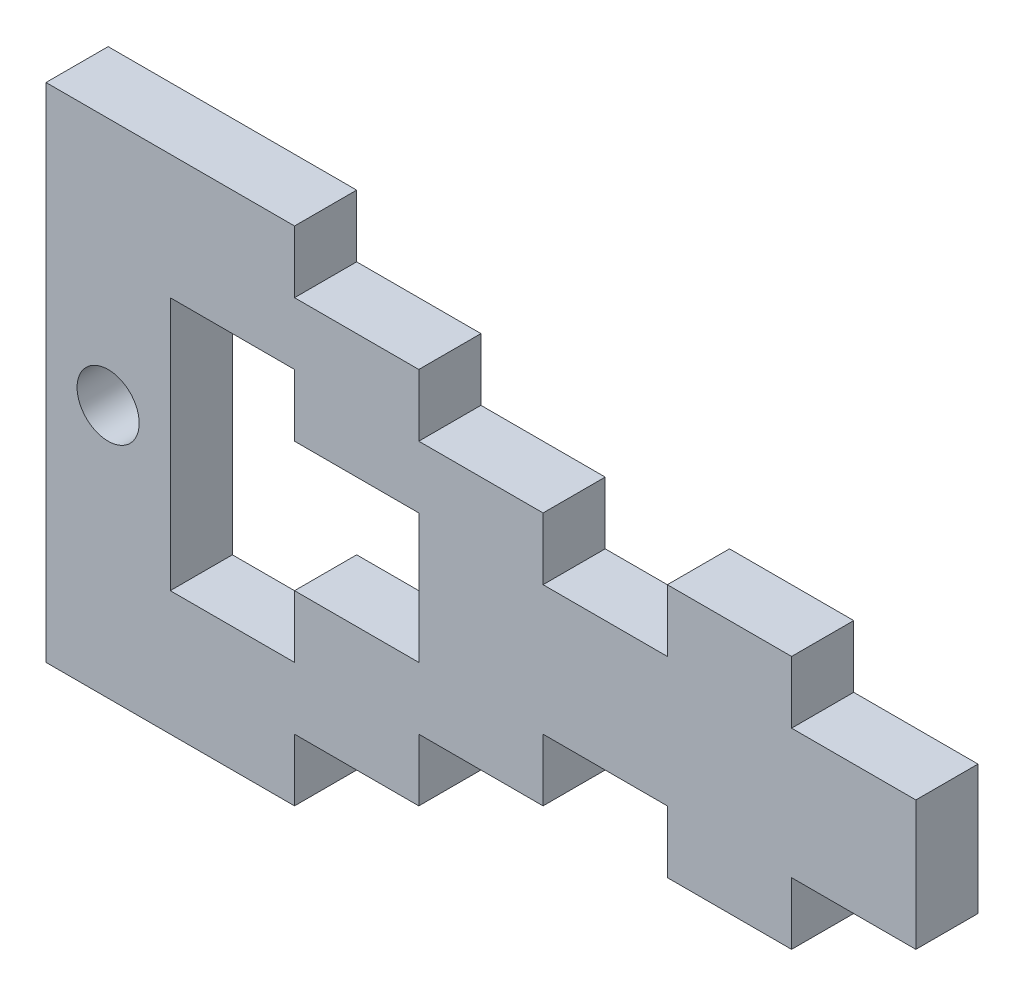
ISO-10303-21;
HEADER;
FILE_DESCRIPTION(('STEP AP214'),'2;1');
FILE_NAME('part.step','',(''),(''),'','','');
FILE_SCHEMA(('AUTOMOTIVE_DESIGN { 1 0 10303 214 1 1 1 1 }'));
ENDSEC;
DATA;
#1=APPLICATION_CONTEXT('core data for automotive mechanical design processes');
#2=APPLICATION_PROTOCOL_DEFINITION('international standard','automotive_design',2000,#1);
#3=PRODUCT_CONTEXT('',#1,'mechanical');
#4=PRODUCT('Part','Part','',(#3));
#5=PRODUCT_RELATED_PRODUCT_CATEGORY('part','',(#4));
#6=PRODUCT_DEFINITION_FORMATION('','',#4);
#7=PRODUCT_DEFINITION_CONTEXT('part definition',#1,'design');
#8=PRODUCT_DEFINITION('design','',#6,#7);
#9=PRODUCT_DEFINITION_SHAPE('','',#8);
#10=(LENGTH_UNIT() NAMED_UNIT(*) SI_UNIT(.MILLI.,.METRE.));
#11=(NAMED_UNIT(*) PLANE_ANGLE_UNIT() SI_UNIT($,.RADIAN.));
#12=(NAMED_UNIT(*) SI_UNIT($,.STERADIAN.) SOLID_ANGLE_UNIT());
#13=UNCERTAINTY_MEASURE_WITH_UNIT(LENGTH_MEASURE(1.E-05),#10,'distance_accuracy_value','');
#14=(GEOMETRIC_REPRESENTATION_CONTEXT(3) GLOBAL_UNCERTAINTY_ASSIGNED_CONTEXT((#13)) GLOBAL_UNIT_ASSIGNED_CONTEXT((#10,
#11,#12)) REPRESENTATION_CONTEXT('',''));
#15=CARTESIAN_POINT('',(0.,0.,0.));
#16=DIRECTION('',(0.,0.,1.));
#17=DIRECTION('',(1.,0.,0.));
#18=AXIS2_PLACEMENT_3D('',#15,#16,#17);
#19=CARTESIAN_POINT('',(0.,0.,3.));
#20=DIRECTION('',(0.,0.,1.));
#21=DIRECTION('',(1.,0.,0.));
#22=AXIS2_PLACEMENT_3D('',#19,#20,#21);
#23=PLANE('',#22);
#24=DIRECTION('',(0.,-1.,0.));
#25=VECTOR('',#24,1.);
#26=CARTESIAN_POINT('',(3240.1067321247,0.,3.));
#27=LINE('',#26,#25);
#28=CARTESIAN_POINT('',(3240.1067321247,1248.38840403903,3.));
#29=VERTEX_POINT('',#28);
#30=CARTESIAN_POINT('',(3240.1067321247,1242.13840403903,3.));
#31=VERTEX_POINT('',#30);
#32=EDGE_CURVE('E457',#29,#31,#27,.T.);
#33=ORIENTED_EDGE('',*,*,#32,.T.);
#34=DIRECTION('',(1.,0.,0.));
#35=VECTOR('',#34,1.);
#36=CARTESIAN_POINT('',(0.,1242.13840403903,3.));
#37=LINE('',#36,#35);
#38=CARTESIAN_POINT('',(3234.1067321247,1242.13840403903,3.));
#39=VERTEX_POINT('',#38);
#40=EDGE_CURVE('E486',#39,#31,#37,.T.);
#41=ORIENTED_EDGE('',*,*,#40,.F.);
#42=DIRECTION('',(0.,1.,0.));
#43=VECTOR('',#42,1.);
#44=CARTESIAN_POINT('',(3234.1067321247,0.,3.));
#45=LINE('',#44,#43);
#46=CARTESIAN_POINT('',(3234.1067321247,1239.13840403903,3.));
#47=VERTEX_POINT('',#46);
#48=EDGE_CURVE('E483',#47,#39,#45,.T.);
#49=ORIENTED_EDGE('',*,*,#48,.F.);
#50=DIRECTION('',(1.,0.,0.));
#51=VECTOR('',#50,1.);
#52=CARTESIAN_POINT('',(0.,1239.13840403903,3.));
#53=LINE('',#52,#51);
#54=CARTESIAN_POINT('',(3228.1067321247,1239.13840403903,3.));
#55=VERTEX_POINT('',#54);
#56=EDGE_CURVE('E480',#55,#47,#53,.T.);
#57=ORIENTED_EDGE('',*,*,#56,.F.);
#58=DIRECTION('',(0.,-1.,0.));
#59=VECTOR('',#58,1.);
#60=CARTESIAN_POINT('',(3228.1067321247,0.,3.));
#61=LINE('',#60,#59);
#62=CARTESIAN_POINT('',(3228.1067321247,1251.38840403903,3.));
#63=VERTEX_POINT('',#62);
#64=EDGE_CURVE('E477',#63,#55,#61,.T.);
#65=ORIENTED_EDGE('',*,*,#64,.F.);
#66=DIRECTION('',(-1.,0.,0.));
#67=VECTOR('',#66,1.);
#68=CARTESIAN_POINT('',(0.,1251.38840403903,3.));
#69=LINE('',#68,#67);
#70=CARTESIAN_POINT('',(3234.1067321247,1251.38840403903,3.));
#71=VERTEX_POINT('',#70);
#72=EDGE_CURVE('E472',#71,#63,#69,.T.);
#73=ORIENTED_EDGE('',*,*,#72,.F.);
#74=DIRECTION('',(0.,1.,0.));
#75=VECTOR('',#74,1.);
#76=CARTESIAN_POINT('',(3234.1067321247,0.,3.));
#77=LINE('',#76,#75);
#78=CARTESIAN_POINT('',(3234.1067321247,1248.38840403903,3.));
#79=VERTEX_POINT('',#78);
#80=EDGE_CURVE('E468',#79,#71,#77,.T.);
#81=ORIENTED_EDGE('',*,*,#80,.F.);
#82=DIRECTION('',(-1.,0.,0.));
#83=VECTOR('',#82,1.);
#84=CARTESIAN_POINT('',(0.,1248.38840403903,3.));
#85=LINE('',#84,#83);
#86=EDGE_CURVE('E448',#29,#79,#85,.T.);
#87=ORIENTED_EDGE('',*,*,#86,.F.);
#88=EDGE_LOOP('',(#33,#41,#49,#57,#65,#73,#81,#87));
#89=FACE_BOUND('',#88,.T.);
#90=DIRECTION('',(-1.,0.,0.));
#91=VECTOR('',#90,1.);
#92=CARTESIAN_POINT('',(3228.1067321247,1257.38840403903,3.));
#93=LINE('',#92,#91);
#94=CARTESIAN_POINT('',(3234.1067321247,1257.38840403903,3.));
#95=VERTEX_POINT('',#94);
#96=CARTESIAN_POINT('',(3222.1067321247,1257.38840403903,3.));
#97=VERTEX_POINT('',#96);
#98=EDGE_CURVE('E542',#95,#97,#93,.T.);
#99=ORIENTED_EDGE('',*,*,#98,.T.);
#100=DIRECTION('',(0.,-1.,0.));
#101=VECTOR('',#100,1.);
#102=CARTESIAN_POINT('',(3222.1067321247,1257.38840403903,3.));
#103=LINE('',#102,#101);
#104=CARTESIAN_POINT('',(3222.1067321247,1233.13840403903,3.));
#105=VERTEX_POINT('',#104);
#106=EDGE_CURVE('E546',#97,#105,#103,.T.);
#107=ORIENTED_EDGE('',*,*,#106,.T.);
#108=DIRECTION('',(1.,0.,0.));
#109=VECTOR('',#108,1.);
#110=CARTESIAN_POINT('',(3222.1067321247,1233.13840403903,3.));
#111=LINE('',#110,#109);
#112=CARTESIAN_POINT('',(3234.1067321247,1233.13840403903,3.));
#113=VERTEX_POINT('',#112);
#114=EDGE_CURVE('E550',#105,#113,#111,.T.);
#115=ORIENTED_EDGE('',*,*,#114,.T.);
#116=DIRECTION('',(0.,-1.,0.));
#117=VECTOR('',#116,1.);
#118=CARTESIAN_POINT('',(3234.1067321247,1236.13840403903,3.));
#119=LINE('',#118,#117);
#120=CARTESIAN_POINT('',(3234.1067321247,1236.13840403903,3.));
#121=VERTEX_POINT('',#120);
#122=EDGE_CURVE('E553',#121,#113,#119,.T.);
#123=ORIENTED_EDGE('',*,*,#122,.F.);
#124=DIRECTION('',(-1.,0.,0.));
#125=VECTOR('',#124,1.);
#126=CARTESIAN_POINT('',(3240.1067321247,1236.13840403903,3.));
#127=LINE('',#126,#125);
#128=CARTESIAN_POINT('',(3240.1067321247,1236.13840403903,3.));
#129=VERTEX_POINT('',#128);
#130=EDGE_CURVE('E557',#129,#121,#127,.T.);
#131=ORIENTED_EDGE('',*,*,#130,.F.);
#132=DIRECTION('',(0.,-1.,0.));
#133=VECTOR('',#132,1.);
#134=CARTESIAN_POINT('',(3240.1067321247,1239.13840403903,3.));
#135=LINE('',#134,#133);
#136=CARTESIAN_POINT('',(3240.1067321247,1239.13840403903,3.));
#137=VERTEX_POINT('',#136);
#138=EDGE_CURVE('E561',#137,#129,#135,.T.);
#139=ORIENTED_EDGE('',*,*,#138,.F.);
#140=DIRECTION('',(-1.,0.,0.));
#141=VECTOR('',#140,1.);
#142=CARTESIAN_POINT('',(3246.1067321247,1239.13840403903,3.));
#143=LINE('',#142,#141);
#144=CARTESIAN_POINT('',(3246.1067321247,1239.13840403903,3.));
#145=VERTEX_POINT('',#144);
#146=EDGE_CURVE('E565',#145,#137,#143,.T.);
#147=ORIENTED_EDGE('',*,*,#146,.F.);
#148=DIRECTION('',(0.,-1.,0.));
#149=VECTOR('',#148,1.);
#150=CARTESIAN_POINT('',(3246.1067321247,1242.13840403903,3.));
#151=LINE('',#150,#149);
#152=CARTESIAN_POINT('',(3246.1067321247,1242.13840403903,3.));
#153=VERTEX_POINT('',#152);
#154=EDGE_CURVE('E569',#153,#145,#151,.T.);
#155=ORIENTED_EDGE('',*,*,#154,.F.);
#156=DIRECTION('',(-1.,0.,0.));
#157=VECTOR('',#156,1.);
#158=CARTESIAN_POINT('',(3252.1067321247,1242.13840403903,3.));
#159=LINE('',#158,#157);
#160=CARTESIAN_POINT('',(3252.1067321247,1242.13840403903,3.));
#161=VERTEX_POINT('',#160);
#162=EDGE_CURVE('E573',#161,#153,#159,.T.);
#163=ORIENTED_EDGE('',*,*,#162,.F.);
#164=DIRECTION('',(0.,1.,0.));
#165=VECTOR('',#164,1.);
#166=CARTESIAN_POINT('',(3252.1067321247,1239.13840403903,3.));
#167=LINE('',#166,#165);
#168=CARTESIAN_POINT('',(3252.1067321247,1239.13840403903,3.));
#169=VERTEX_POINT('',#168);
#170=EDGE_CURVE('E577',#169,#161,#167,.T.);
#171=ORIENTED_EDGE('',*,*,#170,.F.);
#172=DIRECTION('',(-1.,0.,0.));
#173=VECTOR('',#172,1.);
#174=CARTESIAN_POINT('',(3258.1067321247,1239.13840403903,3.));
#175=LINE('',#174,#173);
#176=CARTESIAN_POINT('',(3258.1067321247,1239.13840403903,3.));
#177=VERTEX_POINT('',#176);
#178=EDGE_CURVE('E581',#177,#169,#175,.T.);
#179=ORIENTED_EDGE('',*,*,#178,.F.);
#180=DIRECTION('',(0.,-1.,0.));
#181=VECTOR('',#180,1.);
#182=CARTESIAN_POINT('',(3258.1067321247,1242.13840403903,3.));
#183=LINE('',#182,#181);
#184=CARTESIAN_POINT('',(3258.1067321247,1242.13840403903,3.));
#185=VERTEX_POINT('',#184);
#186=EDGE_CURVE('E585',#185,#177,#183,.T.);
#187=ORIENTED_EDGE('',*,*,#186,.F.);
#188=DIRECTION('',(-1.,0.,0.));
#189=VECTOR('',#188,1.);
#190=CARTESIAN_POINT('',(3264.1067321247,1242.13840403903,3.));
#191=LINE('',#190,#189);
#192=CARTESIAN_POINT('',(3264.1067321247,1242.13840403903,3.));
#193=VERTEX_POINT('',#192);
#194=EDGE_CURVE('E589',#193,#185,#191,.T.);
#195=ORIENTED_EDGE('',*,*,#194,.F.);
#196=DIRECTION('',(0.,1.,0.));
#197=VECTOR('',#196,1.);
#198=CARTESIAN_POINT('',(3264.1067321247,1242.13840403903,3.));
#199=LINE('',#198,#197);
#200=CARTESIAN_POINT('',(3264.1067321247,1248.38840403903,3.));
#201=VERTEX_POINT('',#200);
#202=EDGE_CURVE('E593',#193,#201,#199,.T.);
#203=ORIENTED_EDGE('',*,*,#202,.T.);
#204=DIRECTION('',(1.,0.,0.));
#205=VECTOR('',#204,1.);
#206=CARTESIAN_POINT('',(3258.1067321247,1248.38840403903,3.));
#207=LINE('',#206,#205);
#208=CARTESIAN_POINT('',(3258.1067321247,1248.38840403903,3.));
#209=VERTEX_POINT('',#208);
#210=EDGE_CURVE('E596',#209,#201,#207,.T.);
#211=ORIENTED_EDGE('',*,*,#210,.F.);
#212=DIRECTION('',(0.,1.,0.));
#213=VECTOR('',#212,1.);
#214=CARTESIAN_POINT('',(3258.1067321247,1248.38840403903,3.));
#215=LINE('',#214,#213);
#216=CARTESIAN_POINT('',(3258.1067321247,1251.38840403903,3.));
#217=VERTEX_POINT('',#216);
#218=EDGE_CURVE('E600',#209,#217,#215,.T.);
#219=ORIENTED_EDGE('',*,*,#218,.T.);
#220=DIRECTION('',(-1.,0.,0.));
#221=VECTOR('',#220,1.);
#222=CARTESIAN_POINT('',(3258.1067321247,1251.38840403903,3.));
#223=LINE('',#222,#221);
#224=CARTESIAN_POINT('',(3252.1067321247,1251.38840403903,3.));
#225=VERTEX_POINT('',#224);
#226=EDGE_CURVE('E603',#217,#225,#223,.T.);
#227=ORIENTED_EDGE('',*,*,#226,.T.);
#228=DIRECTION('',(0.,-1.,0.));
#229=VECTOR('',#228,1.);
#230=CARTESIAN_POINT('',(3252.1067321247,1251.38840403903,3.));
#231=LINE('',#230,#229);
#232=CARTESIAN_POINT('',(3252.1067321247,1248.38840403903,3.));
#233=VERTEX_POINT('',#232);
#234=EDGE_CURVE('E606',#225,#233,#231,.T.);
#235=ORIENTED_EDGE('',*,*,#234,.T.);
#236=DIRECTION('',(-1.,0.,0.));
#237=VECTOR('',#236,1.);
#238=CARTESIAN_POINT('',(3252.1067321247,1248.38840403903,3.));
#239=LINE('',#238,#237);
#240=CARTESIAN_POINT('',(3246.1067321247,1248.38840403903,3.));
#241=VERTEX_POINT('',#240);
#242=EDGE_CURVE('E609',#233,#241,#239,.T.);
#243=ORIENTED_EDGE('',*,*,#242,.T.);
#244=DIRECTION('',(0.,1.,0.));
#245=VECTOR('',#244,1.);
#246=CARTESIAN_POINT('',(3246.1067321247,1248.38840403903,3.));
#247=LINE('',#246,#245);
#248=CARTESIAN_POINT('',(3246.1067321247,1251.38840403903,3.));
#249=VERTEX_POINT('',#248);
#250=EDGE_CURVE('E612',#241,#249,#247,.T.);
#251=ORIENTED_EDGE('',*,*,#250,.T.);
#252=DIRECTION('',(-1.,0.,0.));
#253=VECTOR('',#252,1.);
#254=CARTESIAN_POINT('',(3246.1067321247,1251.38840403903,3.));
#255=LINE('',#254,#253);
#256=CARTESIAN_POINT('',(3240.1067321247,1251.38840403903,3.));
#257=VERTEX_POINT('',#256);
#258=EDGE_CURVE('E615',#249,#257,#255,.T.);
#259=ORIENTED_EDGE('',*,*,#258,.T.);
#260=DIRECTION('',(0.,1.,0.));
#261=VECTOR('',#260,1.);
#262=CARTESIAN_POINT('',(3240.1067321247,1251.38840403903,3.));
#263=LINE('',#262,#261);
#264=CARTESIAN_POINT('',(3240.1067321247,1254.38840403903,3.));
#265=VERTEX_POINT('',#264);
#266=EDGE_CURVE('E618',#257,#265,#263,.T.);
#267=ORIENTED_EDGE('',*,*,#266,.T.);
#268=DIRECTION('',(-1.,0.,0.));
#269=VECTOR('',#268,1.);
#270=CARTESIAN_POINT('',(3240.1067321247,1254.38840403903,3.));
#271=LINE('',#270,#269);
#272=CARTESIAN_POINT('',(3234.1067321247,1254.38840403903,3.));
#273=VERTEX_POINT('',#272);
#274=EDGE_CURVE('E621',#265,#273,#271,.T.);
#275=ORIENTED_EDGE('',*,*,#274,.T.);
#276=DIRECTION('',(0.,1.,0.));
#277=VECTOR('',#276,1.);
#278=CARTESIAN_POINT('',(3234.1067321247,1254.38840403903,3.));
#279=LINE('',#278,#277);
#280=EDGE_CURVE('E624',#273,#95,#279,.T.);
#281=ORIENTED_EDGE('',*,*,#280,.T.);
#282=EDGE_LOOP('',(#99,#107,#115,#123,#131,#139,#147,#155,#163,#171,#179,#187,#195,#203,#211,
#219,#227,#235,#243,#251,#259,#267,#275,#281));
#283=FACE_BOUND('',#282,.T.);
#284=CARTESIAN_POINT('',(3225.1067321247,1245.38840403903,3.));
#285=DIRECTION('',(0.,0.,1.));
#286=DIRECTION('',(1.,0.,0.));
#287=AXIS2_PLACEMENT_3D('',#284,#285,#286);
#288=CIRCLE('',#287,1.50000000000006);
#289=CARTESIAN_POINT('',(3226.6067321247,1245.38840403903,3.));
#290=VERTEX_POINT('',#289);
#291=EDGE_CURVE('E534',#290,#290,#288,.T.);
#292=ORIENTED_EDGE('',*,*,#291,.F.);
#293=EDGE_LOOP('',(#292));
#294=FACE_BOUND('',#293,.T.);
#295=ADVANCED_FACE('F234',(#89,#283,#294),#23,.T.);
#296=CARTESIAN_POINT('',(0.,0.,0.));
#297=DIRECTION('',(0.,0.,1.));
#298=DIRECTION('',(1.,0.,0.));
#299=AXIS2_PLACEMENT_3D('',#296,#297,#298);
#300=PLANE('',#299);
#301=DIRECTION('',(1.,0.,0.));
#302=VECTOR('',#301,1.);
#303=CARTESIAN_POINT('',(0.,1242.13840403903,0.));
#304=LINE('',#303,#302);
#305=CARTESIAN_POINT('',(3234.1067321247,1242.13840403903,0.));
#306=VERTEX_POINT('',#305);
#307=CARTESIAN_POINT('',(3240.1067321247,1242.13840403903,0.));
#308=VERTEX_POINT('',#307);
#309=EDGE_CURVE('E463',#306,#308,#304,.T.);
#310=ORIENTED_EDGE('',*,*,#309,.T.);
#311=DIRECTION('',(0.,-1.,0.));
#312=VECTOR('',#311,1.);
#313=CARTESIAN_POINT('',(3240.1067321247,0.,0.));
#314=LINE('',#313,#312);
#315=CARTESIAN_POINT('',(3240.1067321247,1248.38840403903,0.));
#316=VERTEX_POINT('',#315);
#317=EDGE_CURVE('E258',#316,#308,#314,.T.);
#318=ORIENTED_EDGE('',*,*,#317,.F.);
#319=DIRECTION('',(-1.,0.,0.));
#320=VECTOR('',#319,1.);
#321=CARTESIAN_POINT('',(0.,1248.38840403903,0.));
#322=LINE('',#321,#320);
#323=CARTESIAN_POINT('',(3234.1067321247,1248.38840403903,0.));
#324=VERTEX_POINT('',#323);
#325=EDGE_CURVE('E451',#316,#324,#322,.T.);
#326=ORIENTED_EDGE('',*,*,#325,.T.);
#327=DIRECTION('',(0.,1.,0.));
#328=VECTOR('',#327,1.);
#329=CARTESIAN_POINT('',(3234.1067321247,0.,0.));
#330=LINE('',#329,#328);
#331=CARTESIAN_POINT('',(3234.1067321247,1251.38840403903,0.));
#332=VERTEX_POINT('',#331);
#333=EDGE_CURVE('E493',#324,#332,#330,.T.);
#334=ORIENTED_EDGE('',*,*,#333,.T.);
#335=DIRECTION('',(-1.,0.,0.));
#336=VECTOR('',#335,1.);
#337=CARTESIAN_POINT('',(0.,1251.38840403903,0.));
#338=LINE('',#337,#336);
#339=CARTESIAN_POINT('',(3228.1067321247,1251.38840403903,0.));
#340=VERTEX_POINT('',#339);
#341=EDGE_CURVE('E497',#332,#340,#338,.T.);
#342=ORIENTED_EDGE('',*,*,#341,.T.);
#343=DIRECTION('',(0.,-1.,0.));
#344=VECTOR('',#343,1.);
#345=CARTESIAN_POINT('',(3228.1067321247,0.,0.));
#346=LINE('',#345,#344);
#347=CARTESIAN_POINT('',(3228.1067321247,1239.13840403903,0.));
#348=VERTEX_POINT('',#347);
#349=EDGE_CURVE('E501',#340,#348,#346,.T.);
#350=ORIENTED_EDGE('',*,*,#349,.T.);
#351=DIRECTION('',(1.,0.,0.));
#352=VECTOR('',#351,1.);
#353=CARTESIAN_POINT('',(0.,1239.13840403903,0.));
#354=LINE('',#353,#352);
#355=CARTESIAN_POINT('',(3234.1067321247,1239.13840403903,0.));
#356=VERTEX_POINT('',#355);
#357=EDGE_CURVE('E505',#348,#356,#354,.T.);
#358=ORIENTED_EDGE('',*,*,#357,.T.);
#359=DIRECTION('',(0.,1.,0.));
#360=VECTOR('',#359,1.);
#361=CARTESIAN_POINT('',(3234.1067321247,0.,0.));
#362=LINE('',#361,#360);
#363=EDGE_CURVE('E509',#356,#306,#362,.T.);
#364=ORIENTED_EDGE('',*,*,#363,.T.);
#365=EDGE_LOOP('',(#310,#318,#326,#334,#342,#350,#358,#364));
#366=FACE_BOUND('',#365,.T.);
#367=DIRECTION('',(0.,1.,0.));
#368=VECTOR('',#367,1.);
#369=CARTESIAN_POINT('',(3222.1067321247,1233.13840403903,0.));
#370=LINE('',#369,#368);
#371=CARTESIAN_POINT('',(3222.1067321247,1233.13840403903,0.));
#372=VERTEX_POINT('',#371);
#373=CARTESIAN_POINT('',(3222.1067321247,1257.38840403903,0.));
#374=VERTEX_POINT('',#373);
#375=EDGE_CURVE('E538',#372,#374,#370,.T.);
#376=ORIENTED_EDGE('',*,*,#375,.T.);
#377=DIRECTION('',(-1.,0.,0.));
#378=VECTOR('',#377,1.);
#379=CARTESIAN_POINT('',(3234.1067321247,1257.38840403903,0.));
#380=LINE('',#379,#378);
#381=CARTESIAN_POINT('',(3234.1067321247,1257.38840403903,0.));
#382=VERTEX_POINT('',#381);
#383=EDGE_CURVE('E547',#382,#374,#380,.T.);
#384=ORIENTED_EDGE('',*,*,#383,.F.);
#385=DIRECTION('',(0.,1.,0.));
#386=VECTOR('',#385,1.);
#387=CARTESIAN_POINT('',(3234.1067321247,1254.38840403903,0.));
#388=LINE('',#387,#386);
#389=CARTESIAN_POINT('',(3234.1067321247,1254.38840403903,0.));
#390=VERTEX_POINT('',#389);
#391=EDGE_CURVE('E706',#390,#382,#388,.T.);
#392=ORIENTED_EDGE('',*,*,#391,.F.);
#393=DIRECTION('',(-1.,0.,0.));
#394=VECTOR('',#393,1.);
#395=CARTESIAN_POINT('',(3240.1067321247,1254.38840403903,0.));
#396=LINE('',#395,#394);
#397=CARTESIAN_POINT('',(3240.1067321247,1254.38840403903,0.));
#398=VERTEX_POINT('',#397);
#399=EDGE_CURVE('E703',#398,#390,#396,.T.);
#400=ORIENTED_EDGE('',*,*,#399,.F.);
#401=DIRECTION('',(0.,1.,0.));
#402=VECTOR('',#401,1.);
#403=CARTESIAN_POINT('',(3240.1067321247,1251.38840403903,0.));
#404=LINE('',#403,#402);
#405=CARTESIAN_POINT('',(3240.1067321247,1251.38840403903,0.));
#406=VERTEX_POINT('',#405);
#407=EDGE_CURVE('E700',#406,#398,#404,.T.);
#408=ORIENTED_EDGE('',*,*,#407,.F.);
#409=DIRECTION('',(-1.,0.,0.));
#410=VECTOR('',#409,1.);
#411=CARTESIAN_POINT('',(3246.1067321247,1251.38840403903,0.));
#412=LINE('',#411,#410);
#413=CARTESIAN_POINT('',(3246.1067321247,1251.38840403903,0.));
#414=VERTEX_POINT('',#413);
#415=EDGE_CURVE('E697',#414,#406,#412,.T.);
#416=ORIENTED_EDGE('',*,*,#415,.F.);
#417=DIRECTION('',(0.,1.,0.));
#418=VECTOR('',#417,1.);
#419=CARTESIAN_POINT('',(3246.1067321247,1248.38840403903,0.));
#420=LINE('',#419,#418);
#421=CARTESIAN_POINT('',(3246.1067321247,1248.38840403903,0.));
#422=VERTEX_POINT('',#421);
#423=EDGE_CURVE('E694',#422,#414,#420,.T.);
#424=ORIENTED_EDGE('',*,*,#423,.F.);
#425=DIRECTION('',(-1.,0.,0.));
#426=VECTOR('',#425,1.);
#427=CARTESIAN_POINT('',(3252.1067321247,1248.38840403903,0.));
#428=LINE('',#427,#426);
#429=CARTESIAN_POINT('',(3252.1067321247,1248.38840403903,0.));
#430=VERTEX_POINT('',#429);
#431=EDGE_CURVE('E691',#430,#422,#428,.T.);
#432=ORIENTED_EDGE('',*,*,#431,.F.);
#433=DIRECTION('',(0.,-1.,0.));
#434=VECTOR('',#433,1.);
#435=CARTESIAN_POINT('',(3252.1067321247,1251.38840403903,0.));
#436=LINE('',#435,#434);
#437=CARTESIAN_POINT('',(3252.1067321247,1251.38840403903,0.));
#438=VERTEX_POINT('',#437);
#439=EDGE_CURVE('E688',#438,#430,#436,.T.);
#440=ORIENTED_EDGE('',*,*,#439,.F.);
#441=DIRECTION('',(-1.,0.,0.));
#442=VECTOR('',#441,1.);
#443=CARTESIAN_POINT('',(3258.1067321247,1251.38840403903,0.));
#444=LINE('',#443,#442);
#445=CARTESIAN_POINT('',(3258.1067321247,1251.38840403903,0.));
#446=VERTEX_POINT('',#445);
#447=EDGE_CURVE('E685',#446,#438,#444,.T.);
#448=ORIENTED_EDGE('',*,*,#447,.F.);
#449=DIRECTION('',(0.,1.,0.));
#450=VECTOR('',#449,1.);
#451=CARTESIAN_POINT('',(3258.1067321247,1248.38840403903,0.));
#452=LINE('',#451,#450);
#453=CARTESIAN_POINT('',(3258.1067321247,1248.38840403903,0.));
#454=VERTEX_POINT('',#453);
#455=EDGE_CURVE('E682',#454,#446,#452,.T.);
#456=ORIENTED_EDGE('',*,*,#455,.F.);
#457=DIRECTION('',(1.,0.,0.));
#458=VECTOR('',#457,1.);
#459=CARTESIAN_POINT('',(3258.1067321247,1248.38840403903,0.));
#460=LINE('',#459,#458);
#461=CARTESIAN_POINT('',(3264.1067321247,1248.38840403903,0.));
#462=VERTEX_POINT('',#461);
#463=EDGE_CURVE('E678',#454,#462,#460,.T.);
#464=ORIENTED_EDGE('',*,*,#463,.T.);
#465=DIRECTION('',(0.,1.,0.));
#466=VECTOR('',#465,1.);
#467=CARTESIAN_POINT('',(3264.1067321247,1245.38840403903,0.));
#468=LINE('',#467,#466);
#469=CARTESIAN_POINT('',(3264.1067321247,1242.13840403903,0.));
#470=VERTEX_POINT('',#469);
#471=EDGE_CURVE('E674',#470,#462,#468,.T.);
#472=ORIENTED_EDGE('',*,*,#471,.F.);
#473=DIRECTION('',(-1.,0.,0.));
#474=VECTOR('',#473,1.);
#475=CARTESIAN_POINT('',(3264.1067321247,1242.13840403903,0.));
#476=LINE('',#475,#474);
#477=CARTESIAN_POINT('',(3258.1067321247,1242.13840403903,0.));
#478=VERTEX_POINT('',#477);
#479=EDGE_CURVE('E670',#470,#478,#476,.T.);
#480=ORIENTED_EDGE('',*,*,#479,.T.);
#481=DIRECTION('',(0.,-1.,0.));
#482=VECTOR('',#481,1.);
#483=CARTESIAN_POINT('',(3258.1067321247,1242.13840403903,0.));
#484=LINE('',#483,#482);
#485=CARTESIAN_POINT('',(3258.1067321247,1239.13840403903,0.));
#486=VERTEX_POINT('',#485);
#487=EDGE_CURVE('E666',#478,#486,#484,.T.);
#488=ORIENTED_EDGE('',*,*,#487,.T.);
#489=DIRECTION('',(-1.,0.,0.));
#490=VECTOR('',#489,1.);
#491=CARTESIAN_POINT('',(3258.1067321247,1239.13840403903,0.));
#492=LINE('',#491,#490);
#493=CARTESIAN_POINT('',(3252.1067321247,1239.13840403903,0.));
#494=VERTEX_POINT('',#493);
#495=EDGE_CURVE('E662',#486,#494,#492,.T.);
#496=ORIENTED_EDGE('',*,*,#495,.T.);
#497=DIRECTION('',(0.,1.,0.));
#498=VECTOR('',#497,1.);
#499=CARTESIAN_POINT('',(3252.1067321247,1239.13840403903,0.));
#500=LINE('',#499,#498);
#501=CARTESIAN_POINT('',(3252.1067321247,1242.13840403903,0.));
#502=VERTEX_POINT('',#501);
#503=EDGE_CURVE('E658',#494,#502,#500,.T.);
#504=ORIENTED_EDGE('',*,*,#503,.T.);
#505=DIRECTION('',(-1.,0.,0.));
#506=VECTOR('',#505,1.);
#507=CARTESIAN_POINT('',(3252.1067321247,1242.13840403903,0.));
#508=LINE('',#507,#506);
#509=CARTESIAN_POINT('',(3246.1067321247,1242.13840403903,0.));
#510=VERTEX_POINT('',#509);
#511=EDGE_CURVE('E654',#502,#510,#508,.T.);
#512=ORIENTED_EDGE('',*,*,#511,.T.);
#513=DIRECTION('',(0.,-1.,0.));
#514=VECTOR('',#513,1.);
#515=CARTESIAN_POINT('',(3246.1067321247,1242.13840403903,0.));
#516=LINE('',#515,#514);
#517=CARTESIAN_POINT('',(3246.1067321247,1239.13840403903,0.));
#518=VERTEX_POINT('',#517);
#519=EDGE_CURVE('E650',#510,#518,#516,.T.);
#520=ORIENTED_EDGE('',*,*,#519,.T.);
#521=DIRECTION('',(-1.,0.,0.));
#522=VECTOR('',#521,1.);
#523=CARTESIAN_POINT('',(3246.1067321247,1239.13840403903,0.));
#524=LINE('',#523,#522);
#525=CARTESIAN_POINT('',(3240.1067321247,1239.13840403903,0.));
#526=VERTEX_POINT('',#525);
#527=EDGE_CURVE('E646',#518,#526,#524,.T.);
#528=ORIENTED_EDGE('',*,*,#527,.T.);
#529=DIRECTION('',(0.,-1.,0.));
#530=VECTOR('',#529,1.);
#531=CARTESIAN_POINT('',(3240.1067321247,1239.13840403903,0.));
#532=LINE('',#531,#530);
#533=CARTESIAN_POINT('',(3240.1067321247,1236.13840403903,0.));
#534=VERTEX_POINT('',#533);
#535=EDGE_CURVE('E642',#526,#534,#532,.T.);
#536=ORIENTED_EDGE('',*,*,#535,.T.);
#537=DIRECTION('',(-1.,0.,0.));
#538=VECTOR('',#537,1.);
#539=CARTESIAN_POINT('',(3240.1067321247,1236.13840403903,0.));
#540=LINE('',#539,#538);
#541=CARTESIAN_POINT('',(3234.1067321247,1236.13840403903,0.));
#542=VERTEX_POINT('',#541);
#543=EDGE_CURVE('E638',#534,#542,#540,.T.);
#544=ORIENTED_EDGE('',*,*,#543,.T.);
#545=DIRECTION('',(0.,-1.,0.));
#546=VECTOR('',#545,1.);
#547=CARTESIAN_POINT('',(3234.1067321247,1236.13840403903,0.));
#548=LINE('',#547,#546);
#549=CARTESIAN_POINT('',(3234.1067321247,1233.13840403903,0.));
#550=VERTEX_POINT('',#549);
#551=EDGE_CURVE('E634',#542,#550,#548,.T.);
#552=ORIENTED_EDGE('',*,*,#551,.T.);
#553=DIRECTION('',(-1.,0.,0.));
#554=VECTOR('',#553,1.);
#555=CARTESIAN_POINT('',(3234.1067321247,1233.13840403903,0.));
#556=LINE('',#555,#554);
#557=EDGE_CURVE('E631',#550,#372,#556,.T.);
#558=ORIENTED_EDGE('',*,*,#557,.T.);
#559=EDGE_LOOP('',(#376,#384,#392,#400,#408,#416,#424,#432,#440,#448,#456,#464,#472,#480,#488,
#496,#504,#512,#520,#528,#536,#544,#552,#558));
#560=FACE_BOUND('',#559,.T.);
#561=CARTESIAN_POINT('',(3225.1067321247,1245.38840403903,0.));
#562=DIRECTION('',(0.,0.,1.));
#563=DIRECTION('',(1.,0.,0.));
#564=AXIS2_PLACEMENT_3D('',#561,#562,#563);
#565=CIRCLE('',#564,1.50000000000006);
#566=CARTESIAN_POINT('',(3226.6067321247,1245.38840403903,0.));
#567=VERTEX_POINT('',#566);
#568=EDGE_CURVE('E453',#567,#567,#565,.T.);
#569=ORIENTED_EDGE('',*,*,#568,.T.);
#570=EDGE_LOOP('',(#569));
#571=FACE_BOUND('',#570,.T.);
#572=ADVANCED_FACE('F799',(#366,#560,#571),#300,.F.);
#573=CARTESIAN_POINT('',(3222.1067321247,1233.13840403903,3.));
#574=DIRECTION('',(-1.,0.,0.));
#575=DIRECTION('',(0.,0.,1.));
#576=AXIS2_PLACEMENT_3D('',#573,#574,#575);
#577=PLANE('',#576);
#578=ORIENTED_EDGE('',*,*,#375,.F.);
#579=DIRECTION('',(0.,0.,-1.));
#580=VECTOR('',#579,1.);
#581=CARTESIAN_POINT('',(3222.1067321247,1233.13840403903,3.));
#582=LINE('',#581,#580);
#583=EDGE_CURVE('E243',#105,#372,#582,.T.);
#584=ORIENTED_EDGE('',*,*,#583,.F.);
#585=ORIENTED_EDGE('',*,*,#106,.F.);
#586=DIRECTION('',(0.,0.,-1.));
#587=VECTOR('',#586,1.);
#588=CARTESIAN_POINT('',(3222.1067321247,1257.38840403903,3.));
#589=LINE('',#588,#587);
#590=EDGE_CURVE('E12',#97,#374,#589,.T.);
#591=ORIENTED_EDGE('',*,*,#590,.T.);
#592=EDGE_LOOP('',(#578,#584,#585,#591));
#593=FACE_BOUND('',#592,.T.);
#594=ADVANCED_FACE('F236',(#593),#577,.T.);
#595=CARTESIAN_POINT('',(3234.1067321247,1233.13840403903,3.));
#596=DIRECTION('',(0.,-1.,0.));
#597=DIRECTION('',(0.,0.,-1.));
#598=AXIS2_PLACEMENT_3D('',#595,#596,#597);
#599=PLANE('',#598);
#600=ORIENTED_EDGE('',*,*,#557,.F.);
#601=DIRECTION('',(0.,0.,-1.));
#602=VECTOR('',#601,1.);
#603=CARTESIAN_POINT('',(3234.1067321247,1233.13840403903,3.));
#604=LINE('',#603,#602);
#605=EDGE_CURVE('E784',#113,#550,#604,.T.);
#606=ORIENTED_EDGE('',*,*,#605,.F.);
#607=ORIENTED_EDGE('',*,*,#114,.F.);
#608=ORIENTED_EDGE('',*,*,#583,.T.);
#609=EDGE_LOOP('',(#600,#606,#607,#608));
#610=FACE_BOUND('',#609,.T.);
#611=ADVANCED_FACE('F793',(#610),#599,.T.);
#612=CARTESIAN_POINT('',(3234.1067321247,1236.13840403903,3.));
#613=DIRECTION('',(1.,0.,0.));
#614=DIRECTION('',(0.,0.,-1.));
#615=AXIS2_PLACEMENT_3D('',#612,#613,#614);
#616=PLANE('',#615);
#617=ORIENTED_EDGE('',*,*,#551,.F.);
#618=DIRECTION('',(0.,0.,-1.));
#619=VECTOR('',#618,1.);
#620=CARTESIAN_POINT('',(3234.1067321247,1236.13840403903,3.));
#621=LINE('',#620,#619);
#622=EDGE_CURVE('E781',#121,#542,#621,.T.);
#623=ORIENTED_EDGE('',*,*,#622,.F.);
#624=ORIENTED_EDGE('',*,*,#122,.T.);
#625=ORIENTED_EDGE('',*,*,#605,.T.);
#626=EDGE_LOOP('',(#617,#623,#624,#625));
#627=FACE_BOUND('',#626,.T.);
#628=ADVANCED_FACE('F895',(#627),#616,.T.);
#629=CARTESIAN_POINT('',(3240.1067321247,1236.13840403903,3.));
#630=DIRECTION('',(0.,-1.,0.));
#631=DIRECTION('',(0.,0.,-1.));
#632=AXIS2_PLACEMENT_3D('',#629,#630,#631);
#633=PLANE('',#632);
#634=ORIENTED_EDGE('',*,*,#543,.F.);
#635=DIRECTION('',(0.,0.,-1.));
#636=VECTOR('',#635,1.);
#637=CARTESIAN_POINT('',(3240.1067321247,1236.13840403903,3.));
#638=LINE('',#637,#636);
#639=EDGE_CURVE('E778',#129,#534,#638,.T.);
#640=ORIENTED_EDGE('',*,*,#639,.F.);
#641=ORIENTED_EDGE('',*,*,#130,.T.);
#642=ORIENTED_EDGE('',*,*,#622,.T.);
#643=EDGE_LOOP('',(#634,#640,#641,#642));
#644=FACE_BOUND('',#643,.T.);
#645=ADVANCED_FACE('F891',(#644),#633,.T.);
#646=CARTESIAN_POINT('',(3240.1067321247,1239.13840403903,3.));
#647=DIRECTION('',(1.,0.,0.));
#648=DIRECTION('',(0.,0.,-1.));
#649=AXIS2_PLACEMENT_3D('',#646,#647,#648);
#650=PLANE('',#649);
#651=ORIENTED_EDGE('',*,*,#535,.F.);
#652=DIRECTION('',(0.,0.,-1.));
#653=VECTOR('',#652,1.);
#654=CARTESIAN_POINT('',(3240.1067321247,1239.13840403903,3.));
#655=LINE('',#654,#653);
#656=EDGE_CURVE('E775',#137,#526,#655,.T.);
#657=ORIENTED_EDGE('',*,*,#656,.F.);
#658=ORIENTED_EDGE('',*,*,#138,.T.);
#659=ORIENTED_EDGE('',*,*,#639,.T.);
#660=EDGE_LOOP('',(#651,#657,#658,#659));
#661=FACE_BOUND('',#660,.T.);
#662=ADVANCED_FACE('F887',(#661),#650,.T.);
#663=CARTESIAN_POINT('',(3246.1067321247,1239.13840403903,3.));
#664=DIRECTION('',(0.,-1.,0.));
#665=DIRECTION('',(0.,0.,-1.));
#666=AXIS2_PLACEMENT_3D('',#663,#664,#665);
#667=PLANE('',#666);
#668=ORIENTED_EDGE('',*,*,#527,.F.);
#669=DIRECTION('',(0.,0.,-1.));
#670=VECTOR('',#669,1.);
#671=CARTESIAN_POINT('',(3246.1067321247,1239.13840403903,3.));
#672=LINE('',#671,#670);
#673=EDGE_CURVE('E772',#145,#518,#672,.T.);
#674=ORIENTED_EDGE('',*,*,#673,.F.);
#675=ORIENTED_EDGE('',*,*,#146,.T.);
#676=ORIENTED_EDGE('',*,*,#656,.T.);
#677=EDGE_LOOP('',(#668,#674,#675,#676));
#678=FACE_BOUND('',#677,.T.);
#679=ADVANCED_FACE('F883',(#678),#667,.T.);
#680=CARTESIAN_POINT('',(3246.1067321247,1242.13840403903,3.));
#681=DIRECTION('',(1.,0.,0.));
#682=DIRECTION('',(0.,0.,-1.));
#683=AXIS2_PLACEMENT_3D('',#680,#681,#682);
#684=PLANE('',#683);
#685=ORIENTED_EDGE('',*,*,#519,.F.);
#686=DIRECTION('',(0.,0.,-1.));
#687=VECTOR('',#686,1.);
#688=CARTESIAN_POINT('',(3246.1067321247,1242.13840403903,3.));
#689=LINE('',#688,#687);
#690=EDGE_CURVE('E769',#153,#510,#689,.T.);
#691=ORIENTED_EDGE('',*,*,#690,.F.);
#692=ORIENTED_EDGE('',*,*,#154,.T.);
#693=ORIENTED_EDGE('',*,*,#673,.T.);
#694=EDGE_LOOP('',(#685,#691,#692,#693));
#695=FACE_BOUND('',#694,.T.);
#696=ADVANCED_FACE('F879',(#695),#684,.T.);
#697=CARTESIAN_POINT('',(3252.1067321247,1242.13840403903,3.));
#698=DIRECTION('',(0.,-1.,0.));
#699=DIRECTION('',(0.,0.,-1.));
#700=AXIS2_PLACEMENT_3D('',#697,#698,#699);
#701=PLANE('',#700);
#702=ORIENTED_EDGE('',*,*,#511,.F.);
#703=DIRECTION('',(0.,0.,-1.));
#704=VECTOR('',#703,1.);
#705=CARTESIAN_POINT('',(3252.1067321247,1242.13840403903,3.));
#706=LINE('',#705,#704);
#707=EDGE_CURVE('E766',#161,#502,#706,.T.);
#708=ORIENTED_EDGE('',*,*,#707,.F.);
#709=ORIENTED_EDGE('',*,*,#162,.T.);
#710=ORIENTED_EDGE('',*,*,#690,.T.);
#711=EDGE_LOOP('',(#702,#708,#709,#710));
#712=FACE_BOUND('',#711,.T.);
#713=ADVANCED_FACE('F875',(#712),#701,.T.);
#714=CARTESIAN_POINT('',(3252.1067321247,1239.13840403903,3.));
#715=DIRECTION('',(-1.,0.,0.));
#716=DIRECTION('',(0.,0.,1.));
#717=AXIS2_PLACEMENT_3D('',#714,#715,#716);
#718=PLANE('',#717);
#719=ORIENTED_EDGE('',*,*,#503,.F.);
#720=DIRECTION('',(0.,0.,-1.));
#721=VECTOR('',#720,1.);
#722=CARTESIAN_POINT('',(3252.1067321247,1239.13840403903,3.));
#723=LINE('',#722,#721);
#724=EDGE_CURVE('E763',#169,#494,#723,.T.);
#725=ORIENTED_EDGE('',*,*,#724,.F.);
#726=ORIENTED_EDGE('',*,*,#170,.T.);
#727=ORIENTED_EDGE('',*,*,#707,.T.);
#728=EDGE_LOOP('',(#719,#725,#726,#727));
#729=FACE_BOUND('',#728,.T.);
#730=ADVANCED_FACE('F871',(#729),#718,.T.);
#731=CARTESIAN_POINT('',(3258.1067321247,1239.13840403903,3.));
#732=DIRECTION('',(0.,-1.,0.));
#733=DIRECTION('',(0.,0.,-1.));
#734=AXIS2_PLACEMENT_3D('',#731,#732,#733);
#735=PLANE('',#734);
#736=ORIENTED_EDGE('',*,*,#495,.F.);
#737=DIRECTION('',(0.,0.,-1.));
#738=VECTOR('',#737,1.);
#739=CARTESIAN_POINT('',(3258.1067321247,1239.13840403903,3.));
#740=LINE('',#739,#738);
#741=EDGE_CURVE('E760',#177,#486,#740,.T.);
#742=ORIENTED_EDGE('',*,*,#741,.F.);
#743=ORIENTED_EDGE('',*,*,#178,.T.);
#744=ORIENTED_EDGE('',*,*,#724,.T.);
#745=EDGE_LOOP('',(#736,#742,#743,#744));
#746=FACE_BOUND('',#745,.T.);
#747=ADVANCED_FACE('F867',(#746),#735,.T.);
#748=CARTESIAN_POINT('',(3258.1067321247,1242.13840403903,3.));
#749=DIRECTION('',(1.,0.,0.));
#750=DIRECTION('',(0.,0.,-1.));
#751=AXIS2_PLACEMENT_3D('',#748,#749,#750);
#752=PLANE('',#751);
#753=ORIENTED_EDGE('',*,*,#487,.F.);
#754=DIRECTION('',(0.,0.,-1.));
#755=VECTOR('',#754,1.);
#756=CARTESIAN_POINT('',(3258.1067321247,1242.13840403903,3.));
#757=LINE('',#756,#755);
#758=EDGE_CURVE('E757',#185,#478,#757,.T.);
#759=ORIENTED_EDGE('',*,*,#758,.F.);
#760=ORIENTED_EDGE('',*,*,#186,.T.);
#761=ORIENTED_EDGE('',*,*,#741,.T.);
#762=EDGE_LOOP('',(#753,#759,#760,#761));
#763=FACE_BOUND('',#762,.T.);
#764=ADVANCED_FACE('F863',(#763),#752,.T.);
#765=CARTESIAN_POINT('',(3264.1067321247,1242.13840403903,3.));
#766=DIRECTION('',(0.,-1.,0.));
#767=DIRECTION('',(0.,0.,-1.));
#768=AXIS2_PLACEMENT_3D('',#765,#766,#767);
#769=PLANE('',#768);
#770=ORIENTED_EDGE('',*,*,#479,.F.);
#771=DIRECTION('',(0.,0.,-1.));
#772=VECTOR('',#771,1.);
#773=CARTESIAN_POINT('',(3264.1067321247,1242.13840403903,3.));
#774=LINE('',#773,#772);
#775=EDGE_CURVE('E753',#193,#470,#774,.T.);
#776=ORIENTED_EDGE('',*,*,#775,.F.);
#777=ORIENTED_EDGE('',*,*,#194,.T.);
#778=ORIENTED_EDGE('',*,*,#758,.T.);
#779=EDGE_LOOP('',(#770,#776,#777,#778));
#780=FACE_BOUND('',#779,.T.);
#781=ADVANCED_FACE('F859',(#780),#769,.T.);
#782=CARTESIAN_POINT('',(3264.1067321247,1245.38840403903,3.));
#783=DIRECTION('',(-1.,0.,0.));
#784=DIRECTION('',(0.,0.,1.));
#785=AXIS2_PLACEMENT_3D('',#782,#783,#784);
#786=PLANE('',#785);
#787=ORIENTED_EDGE('',*,*,#471,.T.);
#788=DIRECTION('',(0.,0.,-1.));
#789=VECTOR('',#788,1.);
#790=CARTESIAN_POINT('',(3264.1067321247,1248.38840403903,3.));
#791=LINE('',#790,#789);
#792=EDGE_CURVE('E750',#201,#462,#791,.T.);
#793=ORIENTED_EDGE('',*,*,#792,.F.);
#794=ORIENTED_EDGE('',*,*,#202,.F.);
#795=ORIENTED_EDGE('',*,*,#775,.T.);
#796=EDGE_LOOP('',(#787,#793,#794,#795));
#797=FACE_BOUND('',#796,.T.);
#798=ADVANCED_FACE('F856',(#797),#786,.F.);
#799=CARTESIAN_POINT('',(3258.1067321247,1248.38840403903,3.));
#800=DIRECTION('',(0.,1.,0.));
#801=DIRECTION('',(0.,0.,1.));
#802=AXIS2_PLACEMENT_3D('',#799,#800,#801);
#803=PLANE('',#802);
#804=ORIENTED_EDGE('',*,*,#463,.F.);
#805=DIRECTION('',(0.,0.,-1.));
#806=VECTOR('',#805,1.);
#807=CARTESIAN_POINT('',(3258.1067321247,1248.38840403903,3.));
#808=LINE('',#807,#806);
#809=EDGE_CURVE('E747',#209,#454,#808,.T.);
#810=ORIENTED_EDGE('',*,*,#809,.F.);
#811=ORIENTED_EDGE('',*,*,#210,.T.);
#812=ORIENTED_EDGE('',*,*,#792,.T.);
#813=EDGE_LOOP('',(#804,#810,#811,#812));
#814=FACE_BOUND('',#813,.T.);
#815=ADVANCED_FACE('F851',(#814),#803,.T.);
#816=CARTESIAN_POINT('',(3258.1067321247,1248.38840403903,3.));
#817=DIRECTION('',(-1.,0.,0.));
#818=DIRECTION('',(0.,0.,1.));
#819=AXIS2_PLACEMENT_3D('',#816,#817,#818);
#820=PLANE('',#819);
#821=ORIENTED_EDGE('',*,*,#455,.T.);
#822=DIRECTION('',(0.,0.,-1.));
#823=VECTOR('',#822,1.);
#824=CARTESIAN_POINT('',(3258.1067321247,1251.38840403903,3.));
#825=LINE('',#824,#823);
#826=EDGE_CURVE('E743',#217,#446,#825,.T.);
#827=ORIENTED_EDGE('',*,*,#826,.F.);
#828=ORIENTED_EDGE('',*,*,#218,.F.);
#829=ORIENTED_EDGE('',*,*,#809,.T.);
#830=EDGE_LOOP('',(#821,#827,#828,#829));
#831=FACE_BOUND('',#830,.T.);
#832=ADVANCED_FACE('F848',(#831),#820,.F.);
#833=CARTESIAN_POINT('',(3258.1067321247,1251.38840403903,3.));
#834=DIRECTION('',(0.,-1.,0.));
#835=DIRECTION('',(0.,0.,-1.));
#836=AXIS2_PLACEMENT_3D('',#833,#834,#835);
#837=PLANE('',#836);
#838=ORIENTED_EDGE('',*,*,#447,.T.);
#839=DIRECTION('',(0.,0.,-1.));
#840=VECTOR('',#839,1.);
#841=CARTESIAN_POINT('',(3252.1067321247,1251.38840403903,3.));
#842=LINE('',#841,#840);
#843=EDGE_CURVE('E739',#225,#438,#842,.T.);
#844=ORIENTED_EDGE('',*,*,#843,.F.);
#845=ORIENTED_EDGE('',*,*,#226,.F.);
#846=ORIENTED_EDGE('',*,*,#826,.T.);
#847=EDGE_LOOP('',(#838,#844,#845,#846));
#848=FACE_BOUND('',#847,.T.);
#849=ADVANCED_FACE('F843',(#848),#837,.F.);
#850=CARTESIAN_POINT('',(3252.1067321247,1251.38840403903,3.));
#851=DIRECTION('',(1.,0.,0.));
#852=DIRECTION('',(0.,0.,-1.));
#853=AXIS2_PLACEMENT_3D('',#850,#851,#852);
#854=PLANE('',#853);
#855=ORIENTED_EDGE('',*,*,#439,.T.);
#856=DIRECTION('',(0.,0.,-1.));
#857=VECTOR('',#856,1.);
#858=CARTESIAN_POINT('',(3252.1067321247,1248.38840403903,3.));
#859=LINE('',#858,#857);
#860=EDGE_CURVE('E735',#233,#430,#859,.T.);
#861=ORIENTED_EDGE('',*,*,#860,.F.);
#862=ORIENTED_EDGE('',*,*,#234,.F.);
#863=ORIENTED_EDGE('',*,*,#843,.T.);
#864=EDGE_LOOP('',(#855,#861,#862,#863));
#865=FACE_BOUND('',#864,.T.);
#866=ADVANCED_FACE('F837',(#865),#854,.F.);
#867=CARTESIAN_POINT('',(3252.1067321247,1248.38840403903,3.));
#868=DIRECTION('',(0.,-1.,0.));
#869=DIRECTION('',(0.,0.,-1.));
#870=AXIS2_PLACEMENT_3D('',#867,#868,#869);
#871=PLANE('',#870);
#872=ORIENTED_EDGE('',*,*,#431,.T.);
#873=DIRECTION('',(0.,0.,-1.));
#874=VECTOR('',#873,1.);
#875=CARTESIAN_POINT('',(3246.1067321247,1248.38840403903,3.));
#876=LINE('',#875,#874);
#877=EDGE_CURVE('E731',#241,#422,#876,.T.);
#878=ORIENTED_EDGE('',*,*,#877,.F.);
#879=ORIENTED_EDGE('',*,*,#242,.F.);
#880=ORIENTED_EDGE('',*,*,#860,.T.);
#881=EDGE_LOOP('',(#872,#878,#879,#880));
#882=FACE_BOUND('',#881,.T.);
#883=ADVANCED_FACE('F833',(#882),#871,.F.);
#884=CARTESIAN_POINT('',(3246.1067321247,1248.38840403903,3.));
#885=DIRECTION('',(-1.,0.,0.));
#886=DIRECTION('',(0.,0.,1.));
#887=AXIS2_PLACEMENT_3D('',#884,#885,#886);
#888=PLANE('',#887);
#889=ORIENTED_EDGE('',*,*,#423,.T.);
#890=DIRECTION('',(0.,0.,-1.));
#891=VECTOR('',#890,1.);
#892=CARTESIAN_POINT('',(3246.1067321247,1251.38840403903,3.));
#893=LINE('',#892,#891);
#894=EDGE_CURVE('E727',#249,#414,#893,.T.);
#895=ORIENTED_EDGE('',*,*,#894,.F.);
#896=ORIENTED_EDGE('',*,*,#250,.F.);
#897=ORIENTED_EDGE('',*,*,#877,.T.);
#898=EDGE_LOOP('',(#889,#895,#896,#897));
#899=FACE_BOUND('',#898,.T.);
#900=ADVANCED_FACE('F828',(#899),#888,.F.);
#901=CARTESIAN_POINT('',(3246.1067321247,1251.38840403903,3.));
#902=DIRECTION('',(0.,-1.,0.));
#903=DIRECTION('',(0.,0.,-1.));
#904=AXIS2_PLACEMENT_3D('',#901,#902,#903);
#905=PLANE('',#904);
#906=ORIENTED_EDGE('',*,*,#415,.T.);
#907=DIRECTION('',(0.,0.,-1.));
#908=VECTOR('',#907,1.);
#909=CARTESIAN_POINT('',(3240.1067321247,1251.38840403903,3.));
#910=LINE('',#909,#908);
#911=EDGE_CURVE('E723',#257,#406,#910,.T.);
#912=ORIENTED_EDGE('',*,*,#911,.F.);
#913=ORIENTED_EDGE('',*,*,#258,.F.);
#914=ORIENTED_EDGE('',*,*,#894,.T.);
#915=EDGE_LOOP('',(#906,#912,#913,#914));
#916=FACE_BOUND('',#915,.T.);
#917=ADVANCED_FACE('F822',(#916),#905,.F.);
#918=CARTESIAN_POINT('',(3240.1067321247,1251.38840403903,3.));
#919=DIRECTION('',(-1.,0.,0.));
#920=DIRECTION('',(0.,0.,1.));
#921=AXIS2_PLACEMENT_3D('',#918,#919,#920);
#922=PLANE('',#921);
#923=ORIENTED_EDGE('',*,*,#407,.T.);
#924=DIRECTION('',(0.,0.,-1.));
#925=VECTOR('',#924,1.);
#926=CARTESIAN_POINT('',(3240.1067321247,1254.38840403903,3.));
#927=LINE('',#926,#925);
#928=EDGE_CURVE('E719',#265,#398,#927,.T.);
#929=ORIENTED_EDGE('',*,*,#928,.F.);
#930=ORIENTED_EDGE('',*,*,#266,.F.);
#931=ORIENTED_EDGE('',*,*,#911,.T.);
#932=EDGE_LOOP('',(#923,#929,#930,#931));
#933=FACE_BOUND('',#932,.T.);
#934=ADVANCED_FACE('F818',(#933),#922,.F.);
#935=CARTESIAN_POINT('',(3240.1067321247,1254.38840403903,3.));
#936=DIRECTION('',(0.,-1.,0.));
#937=DIRECTION('',(0.,0.,-1.));
#938=AXIS2_PLACEMENT_3D('',#935,#936,#937);
#939=PLANE('',#938);
#940=ORIENTED_EDGE('',*,*,#399,.T.);
#941=DIRECTION('',(0.,0.,-1.));
#942=VECTOR('',#941,1.);
#943=CARTESIAN_POINT('',(3234.1067321247,1254.38840403903,3.));
#944=LINE('',#943,#942);
#945=EDGE_CURVE('E715',#273,#390,#944,.T.);
#946=ORIENTED_EDGE('',*,*,#945,.F.);
#947=ORIENTED_EDGE('',*,*,#274,.F.);
#948=ORIENTED_EDGE('',*,*,#928,.T.);
#949=EDGE_LOOP('',(#940,#946,#947,#948));
#950=FACE_BOUND('',#949,.T.);
#951=ADVANCED_FACE('F813',(#950),#939,.F.);
#952=CARTESIAN_POINT('',(3234.1067321247,1254.38840403903,3.));
#953=DIRECTION('',(-1.,0.,0.));
#954=DIRECTION('',(0.,0.,1.));
#955=AXIS2_PLACEMENT_3D('',#952,#953,#954);
#956=PLANE('',#955);
#957=ORIENTED_EDGE('',*,*,#391,.T.);
#958=DIRECTION('',(0.,0.,-1.));
#959=VECTOR('',#958,1.);
#960=CARTESIAN_POINT('',(3234.1067321247,1257.38840403903,3.));
#961=LINE('',#960,#959);
#962=EDGE_CURVE('E628',#95,#382,#961,.T.);
#963=ORIENTED_EDGE('',*,*,#962,.F.);
#964=ORIENTED_EDGE('',*,*,#280,.F.);
#965=ORIENTED_EDGE('',*,*,#945,.T.);
#966=EDGE_LOOP('',(#957,#963,#964,#965));
#967=FACE_BOUND('',#966,.T.);
#968=ADVANCED_FACE('F807',(#967),#956,.F.);
#969=CARTESIAN_POINT('',(3234.1067321247,1257.38840403903,3.));
#970=DIRECTION('',(0.,-1.,0.));
#971=DIRECTION('',(0.,0.,-1.));
#972=AXIS2_PLACEMENT_3D('',#969,#970,#971);
#973=PLANE('',#972);
#974=ORIENTED_EDGE('',*,*,#383,.T.);
#975=ORIENTED_EDGE('',*,*,#590,.F.);
#976=ORIENTED_EDGE('',*,*,#98,.F.);
#977=ORIENTED_EDGE('',*,*,#962,.T.);
#978=EDGE_LOOP('',(#974,#975,#976,#977));
#979=FACE_BOUND('',#978,.T.);
#980=ADVANCED_FACE('F803',(#979),#973,.F.);
#981=CARTESIAN_POINT('',(3225.1067321247,1245.38840403903,3.));
#982=DIRECTION('',(0.,0.,-1.));
#983=DIRECTION('',(-1.,0.,0.));
#984=AXIS2_PLACEMENT_3D('',#981,#982,#983);
#985=CYLINDRICAL_SURFACE('',#984,1.50000000000006);
#986=ORIENTED_EDGE('',*,*,#291,.T.);
#987=EDGE_LOOP('',(#986));
#988=FACE_BOUND('',#987,.T.);
#989=ORIENTED_EDGE('',*,*,#568,.F.);
#990=EDGE_LOOP('',(#989));
#991=FACE_BOUND('',#990,.T.);
#992=ADVANCED_FACE('F901',(#988,#991),#985,.F.);
#993=CARTESIAN_POINT('',(3240.1067321247,0.,3.));
#994=DIRECTION('',(1.,0.,0.));
#995=DIRECTION('',(0.,0.,-1.));
#996=AXIS2_PLACEMENT_3D('',#993,#994,#995);
#997=PLANE('',#996);
#998=ORIENTED_EDGE('',*,*,#317,.T.);
#999=DIRECTION('',(0.,0.,-1.));
#1000=VECTOR('',#999,1.);
#1001=CARTESIAN_POINT('',(3240.1067321247,1242.13840403903,3.));
#1002=LINE('',#1001,#1000);
#1003=EDGE_CURVE('E459',#31,#308,#1002,.T.);
#1004=ORIENTED_EDGE('',*,*,#1003,.F.);
#1005=ORIENTED_EDGE('',*,*,#32,.F.);
#1006=DIRECTION('',(0.,0.,-1.));
#1007=VECTOR('',#1006,1.);
#1008=CARTESIAN_POINT('',(3240.1067321247,1248.38840403903,3.));
#1009=LINE('',#1008,#1007);
#1010=EDGE_CURVE('E444',#29,#316,#1009,.T.);
#1011=ORIENTED_EDGE('',*,*,#1010,.T.);
#1012=EDGE_LOOP('',(#998,#1004,#1005,#1011));
#1013=FACE_BOUND('',#1012,.T.);
#1014=ADVANCED_FACE('F458',(#1013),#997,.F.);
#1015=CARTESIAN_POINT('',(0.,1248.38840403903,3.));
#1016=DIRECTION('',(0.,-1.,0.));
#1017=DIRECTION('',(0.,0.,-1.));
#1018=AXIS2_PLACEMENT_3D('',#1015,#1016,#1017);
#1019=PLANE('',#1018);
#1020=ORIENTED_EDGE('',*,*,#325,.F.);
#1021=ORIENTED_EDGE('',*,*,#1010,.F.);
#1022=ORIENTED_EDGE('',*,*,#86,.T.);
#1023=DIRECTION('',(0.,0.,-1.));
#1024=VECTOR('',#1023,1.);
#1025=CARTESIAN_POINT('',(3234.1067321247,1248.38840403903,3.));
#1026=LINE('',#1025,#1024);
#1027=EDGE_CURVE('E454',#79,#324,#1026,.T.);
#1028=ORIENTED_EDGE('',*,*,#1027,.T.);
#1029=EDGE_LOOP('',(#1020,#1021,#1022,#1028));
#1030=FACE_BOUND('',#1029,.T.);
#1031=ADVANCED_FACE('F446',(#1030),#1019,.T.);
#1032=CARTESIAN_POINT('',(3234.1067321247,0.,3.));
#1033=DIRECTION('',(-1.,0.,0.));
#1034=DIRECTION('',(0.,0.,1.));
#1035=AXIS2_PLACEMENT_3D('',#1032,#1033,#1034);
#1036=PLANE('',#1035);
#1037=ORIENTED_EDGE('',*,*,#333,.F.);
#1038=ORIENTED_EDGE('',*,*,#1027,.F.);
#1039=ORIENTED_EDGE('',*,*,#80,.T.);
#1040=DIRECTION('',(0.,0.,-1.));
#1041=VECTOR('',#1040,1.);
#1042=CARTESIAN_POINT('',(3234.1067321247,1251.38840403903,3.));
#1043=LINE('',#1042,#1041);
#1044=EDGE_CURVE('E529',#71,#332,#1043,.T.);
#1045=ORIENTED_EDGE('',*,*,#1044,.T.);
#1046=EDGE_LOOP('',(#1037,#1038,#1039,#1045));
#1047=FACE_BOUND('',#1046,.T.);
#1048=ADVANCED_FACE('F1065',(#1047),#1036,.T.);
#1049=CARTESIAN_POINT('',(0.,1251.38840403903,3.));
#1050=DIRECTION('',(0.,-1.,0.));
#1051=DIRECTION('',(0.,0.,-1.));
#1052=AXIS2_PLACEMENT_3D('',#1049,#1050,#1051);
#1053=PLANE('',#1052);
#1054=ORIENTED_EDGE('',*,*,#341,.F.);
#1055=ORIENTED_EDGE('',*,*,#1044,.F.);
#1056=ORIENTED_EDGE('',*,*,#72,.T.);
#1057=DIRECTION('',(0.,0.,-1.));
#1058=VECTOR('',#1057,1.);
#1059=CARTESIAN_POINT('',(3228.1067321247,1251.38840403903,3.));
#1060=LINE('',#1059,#1058);
#1061=EDGE_CURVE('E526',#63,#340,#1060,.T.);
#1062=ORIENTED_EDGE('',*,*,#1061,.T.);
#1063=EDGE_LOOP('',(#1054,#1055,#1056,#1062));
#1064=FACE_BOUND('',#1063,.T.);
#1065=ADVANCED_FACE('F1072',(#1064),#1053,.T.);
#1066=CARTESIAN_POINT('',(3228.1067321247,0.,3.));
#1067=DIRECTION('',(1.,0.,0.));
#1068=DIRECTION('',(0.,0.,-1.));
#1069=AXIS2_PLACEMENT_3D('',#1066,#1067,#1068);
#1070=PLANE('',#1069);
#1071=ORIENTED_EDGE('',*,*,#349,.F.);
#1072=ORIENTED_EDGE('',*,*,#1061,.F.);
#1073=ORIENTED_EDGE('',*,*,#64,.T.);
#1074=DIRECTION('',(0.,0.,-1.));
#1075=VECTOR('',#1074,1.);
#1076=CARTESIAN_POINT('',(3228.1067321247,1239.13840403903,3.));
#1077=LINE('',#1076,#1075);
#1078=EDGE_CURVE('E523',#55,#348,#1077,.T.);
#1079=ORIENTED_EDGE('',*,*,#1078,.T.);
#1080=EDGE_LOOP('',(#1071,#1072,#1073,#1079));
#1081=FACE_BOUND('',#1080,.T.);
#1082=ADVANCED_FACE('F1080',(#1081),#1070,.T.);
#1083=CARTESIAN_POINT('',(0.,1239.13840403903,3.));
#1084=DIRECTION('',(0.,1.,0.));
#1085=DIRECTION('',(0.,0.,1.));
#1086=AXIS2_PLACEMENT_3D('',#1083,#1084,#1085);
#1087=PLANE('',#1086);
#1088=ORIENTED_EDGE('',*,*,#357,.F.);
#1089=ORIENTED_EDGE('',*,*,#1078,.F.);
#1090=ORIENTED_EDGE('',*,*,#56,.T.);
#1091=DIRECTION('',(0.,0.,-1.));
#1092=VECTOR('',#1091,1.);
#1093=CARTESIAN_POINT('',(3234.1067321247,1239.13840403903,3.));
#1094=LINE('',#1093,#1092);
#1095=EDGE_CURVE('E520',#47,#356,#1094,.T.);
#1096=ORIENTED_EDGE('',*,*,#1095,.T.);
#1097=EDGE_LOOP('',(#1088,#1089,#1090,#1096));
#1098=FACE_BOUND('',#1097,.T.);
#1099=ADVANCED_FACE('F1088',(#1098),#1087,.T.);
#1100=CARTESIAN_POINT('',(3234.1067321247,0.,3.));
#1101=DIRECTION('',(-1.,0.,0.));
#1102=DIRECTION('',(0.,0.,1.));
#1103=AXIS2_PLACEMENT_3D('',#1100,#1101,#1102);
#1104=PLANE('',#1103);
#1105=ORIENTED_EDGE('',*,*,#363,.F.);
#1106=ORIENTED_EDGE('',*,*,#1095,.F.);
#1107=ORIENTED_EDGE('',*,*,#48,.T.);
#1108=DIRECTION('',(0.,0.,-1.));
#1109=VECTOR('',#1108,1.);
#1110=CARTESIAN_POINT('',(3234.1067321247,1242.13840403903,3.));
#1111=LINE('',#1110,#1109);
#1112=EDGE_CURVE('E250',#39,#306,#1111,.T.);
#1113=ORIENTED_EDGE('',*,*,#1112,.T.);
#1114=EDGE_LOOP('',(#1105,#1106,#1107,#1113));
#1115=FACE_BOUND('',#1114,.T.);
#1116=ADVANCED_FACE('F1096',(#1115),#1104,.T.);
#1117=CARTESIAN_POINT('',(0.,1242.13840403903,3.));
#1118=DIRECTION('',(0.,1.,0.));
#1119=DIRECTION('',(0.,0.,1.));
#1120=AXIS2_PLACEMENT_3D('',#1117,#1118,#1119);
#1121=PLANE('',#1120);
#1122=ORIENTED_EDGE('',*,*,#309,.F.);
#1123=ORIENTED_EDGE('',*,*,#1112,.F.);
#1124=ORIENTED_EDGE('',*,*,#40,.T.);
#1125=ORIENTED_EDGE('',*,*,#1003,.T.);
#1126=EDGE_LOOP('',(#1122,#1123,#1124,#1125));
#1127=FACE_BOUND('',#1126,.T.);
#1128=ADVANCED_FACE('F1104',(#1127),#1121,.T.);
#1129=CLOSED_SHELL('',(#295,#572,#594,#611,#628,#645,#662,#679,#696,#713,#730,#747,#764,#781,
#798,#815,#832,#849,#866,#883,#900,#917,#934,#951,#968,#980,#992,#1014,#1031,#1048,#1065,#1082,
#1099,#1116,#1128));
#1130=MANIFOLD_SOLID_BREP('B2',#1129);
#1131=ADVANCED_BREP_SHAPE_REPRESENTATION('',(#18,#1130),#14);
#1132=SHAPE_DEFINITION_REPRESENTATION(#9,#1131);
ENDSEC;
END-ISO-10303-21;
